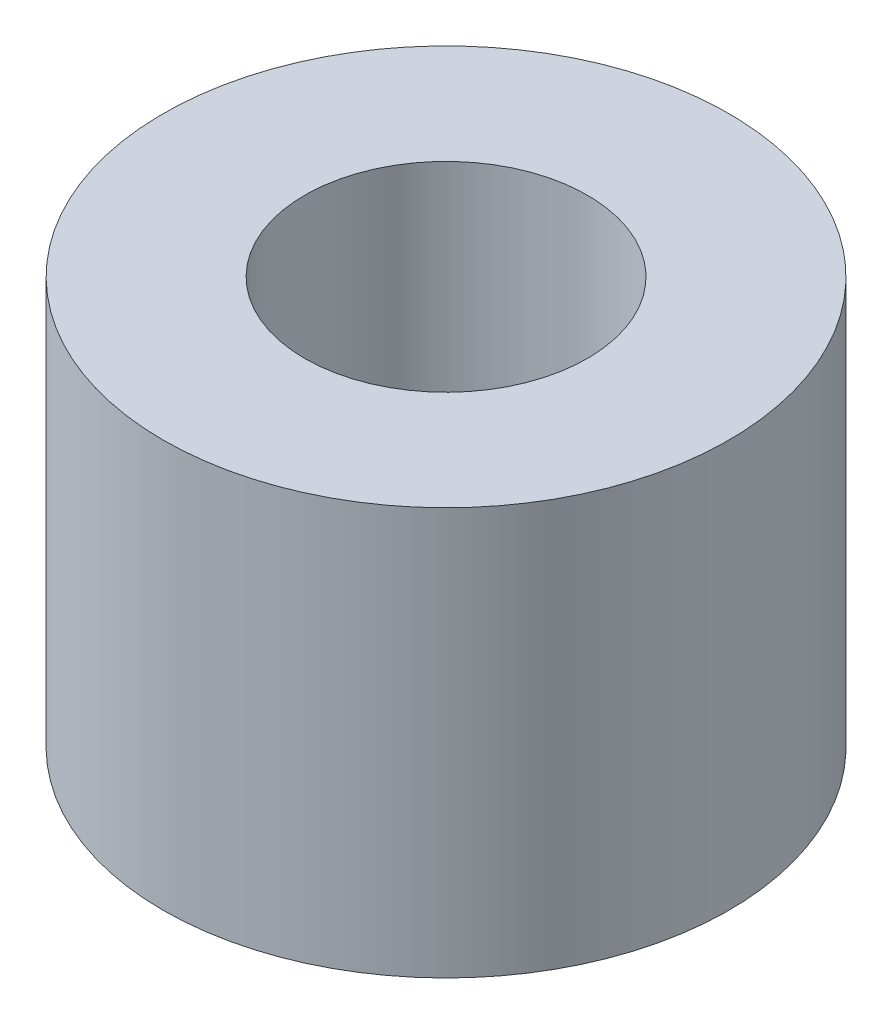
ISO-10303-21;
HEADER;
FILE_DESCRIPTION(('STEP AP214'),'2;1');
FILE_NAME('part.step','',(''),(''),'','','');
FILE_SCHEMA(('AUTOMOTIVE_DESIGN { 1 0 10303 214 1 1 1 1 }'));
ENDSEC;
DATA;
#1=APPLICATION_CONTEXT('core data for automotive mechanical design processes');
#2=APPLICATION_PROTOCOL_DEFINITION('international standard','automotive_design',2000,#1);
#3=PRODUCT_CONTEXT('',#1,'mechanical');
#4=PRODUCT('Part','Part','',(#3));
#5=PRODUCT_RELATED_PRODUCT_CATEGORY('part','',(#4));
#6=PRODUCT_DEFINITION_FORMATION('','',#4);
#7=PRODUCT_DEFINITION_CONTEXT('part definition',#1,'design');
#8=PRODUCT_DEFINITION('design','',#6,#7);
#9=PRODUCT_DEFINITION_SHAPE('','',#8);
#10=(LENGTH_UNIT() NAMED_UNIT(*) SI_UNIT(.MILLI.,.METRE.));
#11=(NAMED_UNIT(*) PLANE_ANGLE_UNIT() SI_UNIT($,.RADIAN.));
#12=(NAMED_UNIT(*) SI_UNIT($,.STERADIAN.) SOLID_ANGLE_UNIT());
#13=UNCERTAINTY_MEASURE_WITH_UNIT(LENGTH_MEASURE(1.E-05),#10,'distance_accuracy_value','');
#14=(GEOMETRIC_REPRESENTATION_CONTEXT(3) GLOBAL_UNCERTAINTY_ASSIGNED_CONTEXT((#13)) GLOBAL_UNIT_ASSIGNED_CONTEXT((#10,
#11,#12)) REPRESENTATION_CONTEXT('',''));
#15=CARTESIAN_POINT('',(0.,0.,0.));
#16=DIRECTION('',(0.,0.,1.));
#17=DIRECTION('',(1.,0.,0.));
#18=AXIS2_PLACEMENT_3D('',#15,#16,#17);
#19=CARTESIAN_POINT('',(0.,33.12,0.));
#20=DIRECTION('',(0.,1.,0.));
#21=DIRECTION('',(0.,0.,1.));
#22=AXIS2_PLACEMENT_3D('',#19,#20,#21);
#23=PLANE('',#22);
#24=CARTESIAN_POINT('',(0.,33.12,0.));
#25=DIRECTION('',(0.,1.,0.));
#26=DIRECTION('',(0.,0.,1.));
#27=AXIS2_PLACEMENT_3D('',#24,#25,#26);
#28=CIRCLE('',#27,23.);
#29=CARTESIAN_POINT('',(0.,33.12,23.));
#30=VERTEX_POINT('',#29);
#31=EDGE_CURVE('E10',#30,#30,#28,.T.);
#32=ORIENTED_EDGE('',*,*,#31,.T.);
#33=EDGE_LOOP('',(#32));
#34=FACE_BOUND('',#33,.T.);
#35=CARTESIAN_POINT('',(0.,33.12,0.));
#36=DIRECTION('',(0.,1.,0.));
#37=DIRECTION('',(0.,0.,1.));
#38=AXIS2_PLACEMENT_3D('',#35,#36,#37);
#39=CIRCLE('',#38,11.5);
#40=CARTESIAN_POINT('',(0.,33.12,11.5));
#41=VERTEX_POINT('',#40);
#42=EDGE_CURVE('E42',#41,#41,#39,.T.);
#43=ORIENTED_EDGE('',*,*,#42,.F.);
#44=EDGE_LOOP('',(#43));
#45=FACE_BOUND('',#44,.T.);
#46=ADVANCED_FACE('F31',(#34,#45),#23,.T.);
#47=CARTESIAN_POINT('',(0.,0.,0.));
#48=DIRECTION('',(0.,1.,0.));
#49=DIRECTION('',(0.,0.,1.));
#50=AXIS2_PLACEMENT_3D('',#47,#48,#49);
#51=PLANE('',#50);
#52=CARTESIAN_POINT('',(0.,0.,0.));
#53=DIRECTION('',(0.,1.,0.));
#54=DIRECTION('',(0.,0.,1.));
#55=AXIS2_PLACEMENT_3D('',#52,#53,#54);
#56=CIRCLE('',#55,23.);
#57=CARTESIAN_POINT('',(0.,0.,23.));
#58=VERTEX_POINT('',#57);
#59=EDGE_CURVE('E35',#58,#58,#56,.T.);
#60=ORIENTED_EDGE('',*,*,#59,.F.);
#61=EDGE_LOOP('',(#60));
#62=FACE_BOUND('',#61,.T.);
#63=CARTESIAN_POINT('',(0.,0.,0.));
#64=DIRECTION('',(0.,1.,0.));
#65=DIRECTION('',(0.,0.,1.));
#66=AXIS2_PLACEMENT_3D('',#63,#64,#65);
#67=CIRCLE('',#66,11.5);
#68=CARTESIAN_POINT('',(0.,0.,11.5));
#69=VERTEX_POINT('',#68);
#70=EDGE_CURVE('E44',#69,#69,#67,.T.);
#71=ORIENTED_EDGE('',*,*,#70,.T.);
#72=EDGE_LOOP('',(#71));
#73=FACE_BOUND('',#72,.T.);
#74=ADVANCED_FACE('F54',(#62,#73),#51,.F.);
#75=CARTESIAN_POINT('',(0.,33.12,0.));
#76=DIRECTION('',(0.,-1.,0.));
#77=DIRECTION('',(0.,0.,-1.));
#78=AXIS2_PLACEMENT_3D('',#75,#76,#77);
#79=CYLINDRICAL_SURFACE('',#78,23.);
#80=ORIENTED_EDGE('',*,*,#31,.F.);
#81=EDGE_LOOP('',(#80));
#82=FACE_BOUND('',#81,.T.);
#83=ORIENTED_EDGE('',*,*,#59,.T.);
#84=EDGE_LOOP('',(#83));
#85=FACE_BOUND('',#84,.T.);
#86=ADVANCED_FACE('F33',(#82,#85),#79,.T.);
#87=CARTESIAN_POINT('',(0.,33.12,0.));
#88=DIRECTION('',(0.,-1.,0.));
#89=DIRECTION('',(0.,0.,-1.));
#90=AXIS2_PLACEMENT_3D('',#87,#88,#89);
#91=CYLINDRICAL_SURFACE('',#90,11.5);
#92=ORIENTED_EDGE('',*,*,#42,.T.);
#93=EDGE_LOOP('',(#92));
#94=FACE_BOUND('',#93,.T.);
#95=ORIENTED_EDGE('',*,*,#70,.F.);
#96=EDGE_LOOP('',(#95));
#97=FACE_BOUND('',#96,.T.);
#98=ADVANCED_FACE('F50',(#94,#97),#91,.F.);
#99=CLOSED_SHELL('',(#46,#74,#86,#98));
#100=MANIFOLD_SOLID_BREP('B2',#99);
#101=ADVANCED_BREP_SHAPE_REPRESENTATION('',(#18,#100),#14);
#102=SHAPE_DEFINITION_REPRESENTATION(#9,#101);
ENDSEC;
END-ISO-10303-21;
